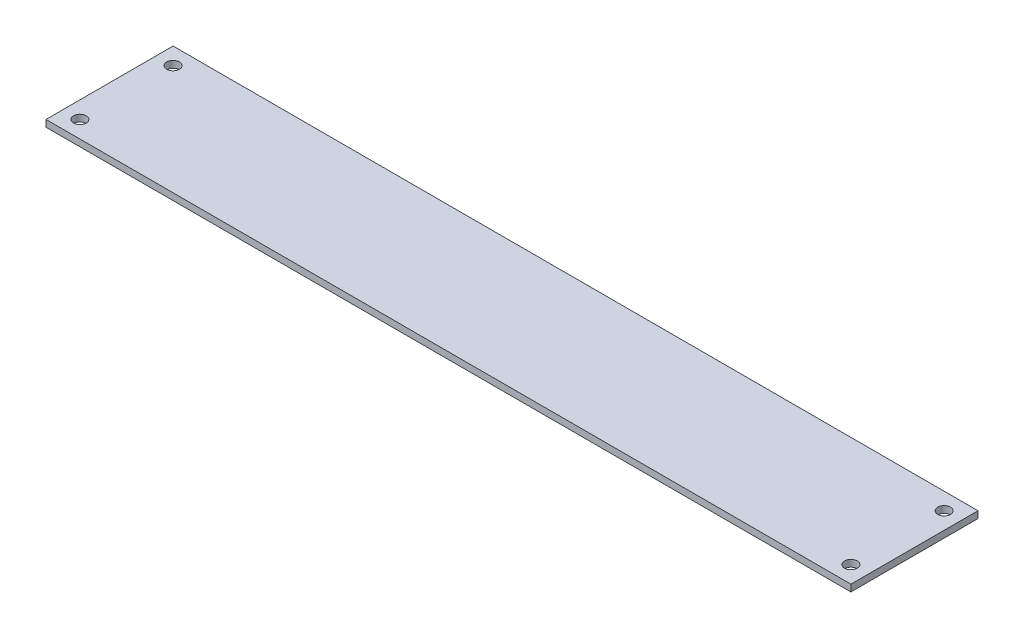
ISO-10303-21;
HEADER;
FILE_DESCRIPTION(('STEP AP214'),'2;1');
FILE_NAME('part.step','',(''),(''),'','','');
FILE_SCHEMA(('AUTOMOTIVE_DESIGN { 1 0 10303 214 1 1 1 1 }'));
ENDSEC;
DATA;
#1=APPLICATION_CONTEXT('core data for automotive mechanical design processes');
#2=APPLICATION_PROTOCOL_DEFINITION('international standard','automotive_design',2000,#1);
#3=PRODUCT_CONTEXT('',#1,'mechanical');
#4=PRODUCT('Part','Part','',(#3));
#5=PRODUCT_RELATED_PRODUCT_CATEGORY('part','',(#4));
#6=PRODUCT_DEFINITION_FORMATION('','',#4);
#7=PRODUCT_DEFINITION_CONTEXT('part definition',#1,'design');
#8=PRODUCT_DEFINITION('design','',#6,#7);
#9=PRODUCT_DEFINITION_SHAPE('','',#8);
#10=(LENGTH_UNIT() NAMED_UNIT(*) SI_UNIT(.MILLI.,.METRE.));
#11=(NAMED_UNIT(*) PLANE_ANGLE_UNIT() SI_UNIT($,.RADIAN.));
#12=(NAMED_UNIT(*) SI_UNIT($,.STERADIAN.) SOLID_ANGLE_UNIT());
#13=UNCERTAINTY_MEASURE_WITH_UNIT(LENGTH_MEASURE(1.E-05),#10,'distance_accuracy_value','');
#14=(GEOMETRIC_REPRESENTATION_CONTEXT(3) GLOBAL_UNCERTAINTY_ASSIGNED_CONTEXT((#13)) GLOBAL_UNIT_ASSIGNED_CONTEXT((#10,
#11,#12)) REPRESENTATION_CONTEXT('',''));
#15=CARTESIAN_POINT('',(0.,0.,0.));
#16=DIRECTION('',(0.,0.,1.));
#17=DIRECTION('',(1.,0.,0.));
#18=AXIS2_PLACEMENT_3D('',#15,#16,#17);
#19=CARTESIAN_POINT('',(95.,1.6,15.));
#20=DIRECTION('',(-1.,0.,0.));
#21=DIRECTION('',(0.,0.,1.));
#22=AXIS2_PLACEMENT_3D('',#19,#20,#21);
#23=PLANE('',#22);
#24=DIRECTION('',(0.,0.,-1.));
#25=VECTOR('',#24,1.);
#26=CARTESIAN_POINT('',(95.,0.,15.));
#27=LINE('',#26,#25);
#28=CARTESIAN_POINT('',(95.,0.,15.));
#29=VERTEX_POINT('',#28);
#30=CARTESIAN_POINT('',(95.,0.,-15.));
#31=VERTEX_POINT('',#30);
#32=EDGE_CURVE('E98',#29,#31,#27,.T.);
#33=ORIENTED_EDGE('',*,*,#32,.T.);
#34=DIRECTION('',(0.,-1.,0.));
#35=VECTOR('',#34,1.);
#36=CARTESIAN_POINT('',(95.,1.6,-15.));
#37=LINE('',#36,#35);
#38=CARTESIAN_POINT('',(95.,1.6,-15.));
#39=VERTEX_POINT('',#38);
#40=EDGE_CURVE('E11',#39,#31,#37,.T.);
#41=ORIENTED_EDGE('',*,*,#40,.F.);
#42=DIRECTION('',(0.,0.,-1.));
#43=VECTOR('',#42,1.);
#44=CARTESIAN_POINT('',(95.,1.6,15.));
#45=LINE('',#44,#43);
#46=CARTESIAN_POINT('',(95.,1.6,15.));
#47=VERTEX_POINT('',#46);
#48=EDGE_CURVE('E86',#47,#39,#45,.T.);
#49=ORIENTED_EDGE('',*,*,#48,.F.);
#50=DIRECTION('',(0.,-1.,0.));
#51=VECTOR('',#50,1.);
#52=CARTESIAN_POINT('',(95.,1.6,15.));
#53=LINE('',#52,#51);
#54=EDGE_CURVE('E94',#47,#29,#53,.T.);
#55=ORIENTED_EDGE('',*,*,#54,.T.);
#56=EDGE_LOOP('',(#33,#41,#49,#55));
#57=FACE_BOUND('',#56,.T.);
#58=ADVANCED_FACE('F35',(#57),#23,.F.);
#59=CARTESIAN_POINT('',(-95.,1.6,-15.));
#60=DIRECTION('',(0.,0.,1.));
#61=DIRECTION('',(1.,0.,0.));
#62=AXIS2_PLACEMENT_3D('',#59,#60,#61);
#63=PLANE('',#62);
#64=DIRECTION('',(-1.,0.,0.));
#65=VECTOR('',#64,1.);
#66=CARTESIAN_POINT('',(-95.,0.,-15.));
#67=LINE('',#66,#65);
#68=CARTESIAN_POINT('',(-95.,0.,-15.));
#69=VERTEX_POINT('',#68);
#70=EDGE_CURVE('E90',#31,#69,#67,.T.);
#71=ORIENTED_EDGE('',*,*,#70,.T.);
#72=DIRECTION('',(0.,-1.,0.));
#73=VECTOR('',#72,1.);
#74=CARTESIAN_POINT('',(-95.,1.6,-15.));
#75=LINE('',#74,#73);
#76=CARTESIAN_POINT('',(-95.,1.6,-15.));
#77=VERTEX_POINT('',#76);
#78=EDGE_CURVE('E43',#77,#69,#75,.T.);
#79=ORIENTED_EDGE('',*,*,#78,.F.);
#80=DIRECTION('',(-1.,0.,0.));
#81=VECTOR('',#80,1.);
#82=CARTESIAN_POINT('',(-95.,1.6,-15.));
#83=LINE('',#82,#81);
#84=EDGE_CURVE('E81',#39,#77,#83,.T.);
#85=ORIENTED_EDGE('',*,*,#84,.F.);
#86=ORIENTED_EDGE('',*,*,#40,.T.);
#87=EDGE_LOOP('',(#71,#79,#85,#86));
#88=FACE_BOUND('',#87,.T.);
#89=ADVANCED_FACE('F89',(#88),#63,.F.);
#90=CARTESIAN_POINT('',(-95.,1.6,15.));
#91=DIRECTION('',(1.,0.,0.));
#92=DIRECTION('',(0.,0.,-1.));
#93=AXIS2_PLACEMENT_3D('',#90,#91,#92);
#94=PLANE('',#93);
#95=DIRECTION('',(0.,0.,1.));
#96=VECTOR('',#95,1.);
#97=CARTESIAN_POINT('',(-95.,0.,15.));
#98=LINE('',#97,#96);
#99=CARTESIAN_POINT('',(-95.,0.,15.));
#100=VERTEX_POINT('',#99);
#101=EDGE_CURVE('E68',#69,#100,#98,.T.);
#102=ORIENTED_EDGE('',*,*,#101,.T.);
#103=DIRECTION('',(0.,-1.,0.));
#104=VECTOR('',#103,1.);
#105=CARTESIAN_POINT('',(-95.,1.6,15.));
#106=LINE('',#105,#104);
#107=CARTESIAN_POINT('',(-95.,1.6,15.));
#108=VERTEX_POINT('',#107);
#109=EDGE_CURVE('E91',#108,#100,#106,.T.);
#110=ORIENTED_EDGE('',*,*,#109,.F.);
#111=DIRECTION('',(0.,0.,1.));
#112=VECTOR('',#111,1.);
#113=CARTESIAN_POINT('',(-95.,1.6,15.));
#114=LINE('',#113,#112);
#115=EDGE_CURVE('E84',#77,#108,#114,.T.);
#116=ORIENTED_EDGE('',*,*,#115,.F.);
#117=ORIENTED_EDGE('',*,*,#78,.T.);
#118=EDGE_LOOP('',(#102,#110,#116,#117));
#119=FACE_BOUND('',#118,.T.);
#120=ADVANCED_FACE('F92',(#119),#94,.F.);
#121=CARTESIAN_POINT('',(-95.,1.6,15.));
#122=DIRECTION('',(0.,0.,-1.));
#123=DIRECTION('',(-1.,0.,0.));
#124=AXIS2_PLACEMENT_3D('',#121,#122,#123);
#125=PLANE('',#124);
#126=DIRECTION('',(1.,0.,0.));
#127=VECTOR('',#126,1.);
#128=CARTESIAN_POINT('',(-95.,0.,15.));
#129=LINE('',#128,#127);
#130=EDGE_CURVE('E74',#100,#29,#129,.T.);
#131=ORIENTED_EDGE('',*,*,#130,.T.);
#132=ORIENTED_EDGE('',*,*,#54,.F.);
#133=DIRECTION('',(1.,0.,0.));
#134=VECTOR('',#133,1.);
#135=CARTESIAN_POINT('',(-95.,1.6,15.));
#136=LINE('',#135,#134);
#137=EDGE_CURVE('E51',#108,#47,#136,.T.);
#138=ORIENTED_EDGE('',*,*,#137,.F.);
#139=ORIENTED_EDGE('',*,*,#109,.T.);
#140=EDGE_LOOP('',(#131,#132,#138,#139));
#141=FACE_BOUND('',#140,.T.);
#142=ADVANCED_FACE('F106',(#141),#125,.F.);
#143=CARTESIAN_POINT('',(0.,1.6,0.));
#144=DIRECTION('',(0.,-1.,0.));
#145=DIRECTION('',(0.,0.,-1.));
#146=AXIS2_PLACEMENT_3D('',#143,#144,#145);
#147=PLANE('',#146);
#148=CARTESIAN_POINT('',(-91.,1.6,-11.));
#149=DIRECTION('',(0.,-1.,0.));
#150=DIRECTION('',(0.,0.,1.));
#151=AXIS2_PLACEMENT_3D('',#148,#149,#150);
#152=CIRCLE('',#151,1.5);
#153=CARTESIAN_POINT('',(-91.,1.6,-9.5));
#154=VERTEX_POINT('',#153);
#155=EDGE_CURVE('E130',#154,#154,#152,.T.);
#156=ORIENTED_EDGE('',*,*,#155,.T.);
#157=EDGE_LOOP('',(#156));
#158=FACE_BOUND('',#157,.T.);
#159=CARTESIAN_POINT('',(-91.,1.6,11.));
#160=DIRECTION('',(0.,1.,0.));
#161=DIRECTION('',(0.,0.,-1.));
#162=AXIS2_PLACEMENT_3D('',#159,#160,#161);
#163=CIRCLE('',#162,1.5);
#164=CARTESIAN_POINT('',(-91.,1.6,9.5));
#165=VERTEX_POINT('',#164);
#166=EDGE_CURVE('E124',#165,#165,#163,.T.);
#167=ORIENTED_EDGE('',*,*,#166,.F.);
#168=EDGE_LOOP('',(#167));
#169=FACE_BOUND('',#168,.T.);
#170=CARTESIAN_POINT('',(91.,1.6,11.));
#171=DIRECTION('',(0.,-1.,0.));
#172=DIRECTION('',(0.,0.,-1.));
#173=AXIS2_PLACEMENT_3D('',#170,#171,#172);
#174=CIRCLE('',#173,1.5);
#175=CARTESIAN_POINT('',(91.,1.6,9.5));
#176=VERTEX_POINT('',#175);
#177=EDGE_CURVE('E118',#176,#176,#174,.T.);
#178=ORIENTED_EDGE('',*,*,#177,.T.);
#179=EDGE_LOOP('',(#178));
#180=FACE_BOUND('',#179,.T.);
#181=CARTESIAN_POINT('',(91.,1.6,-11.));
#182=DIRECTION('',(0.,1.,0.));
#183=DIRECTION('',(0.,0.,1.));
#184=AXIS2_PLACEMENT_3D('',#181,#182,#183);
#185=CIRCLE('',#184,1.5);
#186=CARTESIAN_POINT('',(91.,1.6,-9.5));
#187=VERTEX_POINT('',#186);
#188=EDGE_CURVE('E112',#187,#187,#185,.T.);
#189=ORIENTED_EDGE('',*,*,#188,.F.);
#190=EDGE_LOOP('',(#189));
#191=FACE_BOUND('',#190,.T.);
#192=ORIENTED_EDGE('',*,*,#48,.T.);
#193=ORIENTED_EDGE('',*,*,#84,.T.);
#194=ORIENTED_EDGE('',*,*,#115,.T.);
#195=ORIENTED_EDGE('',*,*,#137,.T.);
#196=EDGE_LOOP('',(#192,#193,#194,#195));
#197=FACE_BOUND('',#196,.T.);
#198=ADVANCED_FACE('F82',(#158,#169,#180,#191,#197),#147,.F.);
#199=CARTESIAN_POINT('',(0.,0.,0.));
#200=DIRECTION('',(0.,-1.,0.));
#201=DIRECTION('',(0.,0.,-1.));
#202=AXIS2_PLACEMENT_3D('',#199,#200,#201);
#203=PLANE('',#202);
#204=CARTESIAN_POINT('',(-91.,0.,-11.));
#205=DIRECTION('',(0.,-1.,0.));
#206=DIRECTION('',(0.,0.,1.));
#207=AXIS2_PLACEMENT_3D('',#204,#205,#206);
#208=CIRCLE('',#207,1.5);
#209=CARTESIAN_POINT('',(-91.,0.,-9.5));
#210=VERTEX_POINT('',#209);
#211=EDGE_CURVE('E127',#210,#210,#208,.T.);
#212=ORIENTED_EDGE('',*,*,#211,.F.);
#213=EDGE_LOOP('',(#212));
#214=FACE_BOUND('',#213,.T.);
#215=CARTESIAN_POINT('',(-91.,0.,11.));
#216=DIRECTION('',(0.,1.,0.));
#217=DIRECTION('',(0.,0.,-1.));
#218=AXIS2_PLACEMENT_3D('',#215,#216,#217);
#219=CIRCLE('',#218,1.5);
#220=CARTESIAN_POINT('',(-91.,0.,9.5));
#221=VERTEX_POINT('',#220);
#222=EDGE_CURVE('E121',#221,#221,#219,.T.);
#223=ORIENTED_EDGE('',*,*,#222,.T.);
#224=EDGE_LOOP('',(#223));
#225=FACE_BOUND('',#224,.T.);
#226=CARTESIAN_POINT('',(91.,0.,11.));
#227=DIRECTION('',(0.,-1.,0.));
#228=DIRECTION('',(0.,0.,-1.));
#229=AXIS2_PLACEMENT_3D('',#226,#227,#228);
#230=CIRCLE('',#229,1.5);
#231=CARTESIAN_POINT('',(91.,0.,9.5));
#232=VERTEX_POINT('',#231);
#233=EDGE_CURVE('E115',#232,#232,#230,.T.);
#234=ORIENTED_EDGE('',*,*,#233,.F.);
#235=EDGE_LOOP('',(#234));
#236=FACE_BOUND('',#235,.T.);
#237=CARTESIAN_POINT('',(91.,0.,-11.));
#238=DIRECTION('',(0.,1.,0.));
#239=DIRECTION('',(0.,0.,1.));
#240=AXIS2_PLACEMENT_3D('',#237,#238,#239);
#241=CIRCLE('',#240,1.5);
#242=CARTESIAN_POINT('',(91.,0.,-9.5));
#243=VERTEX_POINT('',#242);
#244=EDGE_CURVE('E101',#243,#243,#241,.T.);
#245=ORIENTED_EDGE('',*,*,#244,.T.);
#246=EDGE_LOOP('',(#245));
#247=FACE_BOUND('',#246,.T.);
#248=ORIENTED_EDGE('',*,*,#32,.F.);
#249=ORIENTED_EDGE('',*,*,#130,.F.);
#250=ORIENTED_EDGE('',*,*,#101,.F.);
#251=ORIENTED_EDGE('',*,*,#70,.F.);
#252=EDGE_LOOP('',(#248,#249,#250,#251));
#253=FACE_BOUND('',#252,.T.);
#254=ADVANCED_FACE('F109',(#214,#225,#236,#247,#253),#203,.T.);
#255=CARTESIAN_POINT('',(91.,0.,-11.));
#256=DIRECTION('',(0.,1.,0.));
#257=DIRECTION('',(0.,0.,1.));
#258=AXIS2_PLACEMENT_3D('',#255,#256,#257);
#259=CYLINDRICAL_SURFACE('',#258,1.5);
#260=ORIENTED_EDGE('',*,*,#244,.F.);
#261=EDGE_LOOP('',(#260));
#262=FACE_BOUND('',#261,.T.);
#263=ORIENTED_EDGE('',*,*,#188,.T.);
#264=EDGE_LOOP('',(#263));
#265=FACE_BOUND('',#264,.T.);
#266=ADVANCED_FACE('F141',(#262,#265),#259,.F.);
#267=CARTESIAN_POINT('',(91.,0.,11.));
#268=DIRECTION('',(0.,1.,0.));
#269=DIRECTION('',(0.,0.,1.));
#270=AXIS2_PLACEMENT_3D('',#267,#268,#269);
#271=CYLINDRICAL_SURFACE('',#270,1.5);
#272=ORIENTED_EDGE('',*,*,#233,.T.);
#273=EDGE_LOOP('',(#272));
#274=FACE_BOUND('',#273,.T.);
#275=ORIENTED_EDGE('',*,*,#177,.F.);
#276=EDGE_LOOP('',(#275));
#277=FACE_BOUND('',#276,.T.);
#278=ADVANCED_FACE('F151',(#274,#277),#271,.F.);
#279=CARTESIAN_POINT('',(-91.,0.,11.));
#280=DIRECTION('',(0.,1.,0.));
#281=DIRECTION('',(0.,0.,1.));
#282=AXIS2_PLACEMENT_3D('',#279,#280,#281);
#283=CYLINDRICAL_SURFACE('',#282,1.5);
#284=ORIENTED_EDGE('',*,*,#222,.F.);
#285=EDGE_LOOP('',(#284));
#286=FACE_BOUND('',#285,.T.);
#287=ORIENTED_EDGE('',*,*,#166,.T.);
#288=EDGE_LOOP('',(#287));
#289=FACE_BOUND('',#288,.T.);
#290=ADVANCED_FACE('F193',(#286,#289),#283,.F.);
#291=CARTESIAN_POINT('',(-91.,0.,-11.));
#292=DIRECTION('',(0.,1.,0.));
#293=DIRECTION('',(0.,0.,1.));
#294=AXIS2_PLACEMENT_3D('',#291,#292,#293);
#295=CYLINDRICAL_SURFACE('',#294,1.5);
#296=ORIENTED_EDGE('',*,*,#211,.T.);
#297=EDGE_LOOP('',(#296));
#298=FACE_BOUND('',#297,.T.);
#299=ORIENTED_EDGE('',*,*,#155,.F.);
#300=EDGE_LOOP('',(#299));
#301=FACE_BOUND('',#300,.T.);
#302=ADVANCED_FACE('F136',(#298,#301),#295,.F.);
#303=CLOSED_SHELL('',(#58,#89,#120,#142,#198,#254,#266,#278,#290,#302));
#304=MANIFOLD_SOLID_BREP('B2',#303);
#305=ADVANCED_BREP_SHAPE_REPRESENTATION('',(#18,#304),#14);
#306=SHAPE_DEFINITION_REPRESENTATION(#9,#305);
ENDSEC;
END-ISO-10303-21;
